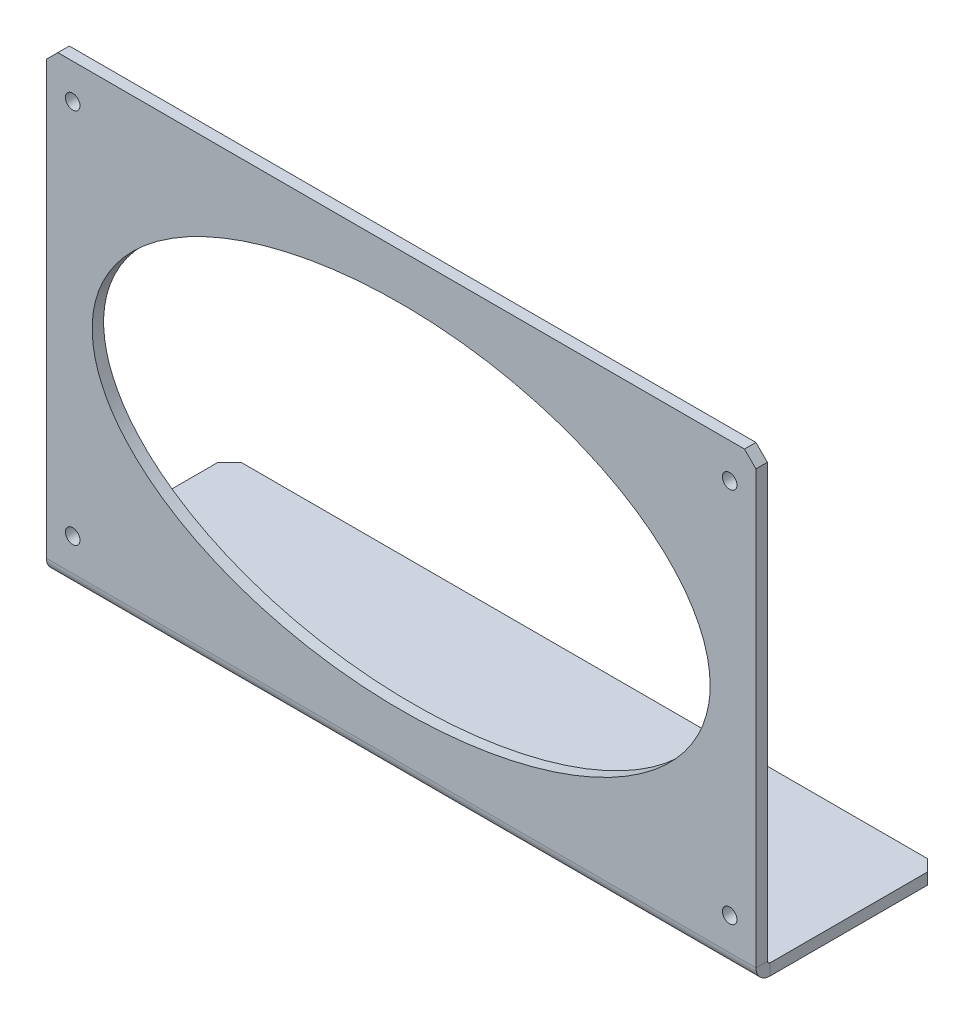
ISO-10303-21;
HEADER;
FILE_DESCRIPTION(('STEP AP214'),'2;1');
FILE_NAME('part.step','',(''),(''),'','','');
FILE_SCHEMA(('AUTOMOTIVE_DESIGN { 1 0 10303 214 1 1 1 1 }'));
ENDSEC;
DATA;
#1=APPLICATION_CONTEXT('core data for automotive mechanical design processes');
#2=APPLICATION_PROTOCOL_DEFINITION('international standard','automotive_design',2000,#1);
#3=PRODUCT_CONTEXT('',#1,'mechanical');
#4=PRODUCT('Part','Part','',(#3));
#5=PRODUCT_RELATED_PRODUCT_CATEGORY('part','',(#4));
#6=PRODUCT_DEFINITION_FORMATION('','',#4);
#7=PRODUCT_DEFINITION_CONTEXT('part definition',#1,'design');
#8=PRODUCT_DEFINITION('design','',#6,#7);
#9=PRODUCT_DEFINITION_SHAPE('','',#8);
#10=(LENGTH_UNIT() NAMED_UNIT(*) SI_UNIT(.MILLI.,.METRE.));
#11=(NAMED_UNIT(*) PLANE_ANGLE_UNIT() SI_UNIT($,.RADIAN.));
#12=(NAMED_UNIT(*) SI_UNIT($,.STERADIAN.) SOLID_ANGLE_UNIT());
#13=UNCERTAINTY_MEASURE_WITH_UNIT(LENGTH_MEASURE(1.E-05),#10,'distance_accuracy_value','');
#14=(GEOMETRIC_REPRESENTATION_CONTEXT(3) GLOBAL_UNCERTAINTY_ASSIGNED_CONTEXT((#13)) GLOBAL_UNIT_ASSIGNED_CONTEXT((#10,
#11,#12)) REPRESENTATION_CONTEXT('',''));
#15=CARTESIAN_POINT('',(0.,0.,0.));
#16=DIRECTION('',(0.,0.,1.));
#17=DIRECTION('',(1.,0.,0.));
#18=AXIS2_PLACEMENT_3D('',#15,#16,#17);
#19=CARTESIAN_POINT('',(98.425,3.9116,50.8));
#20=DIRECTION('',(1.,0.,0.));
#21=DIRECTION('',(0.,0.,-1.));
#22=AXIS2_PLACEMENT_3D('',#19,#20,#21);
#23=PLANE('',#22);
#24=DIRECTION('',(0.,0.,-1.));
#25=VECTOR('',#24,1.);
#26=CARTESIAN_POINT('',(98.425,3.9116,50.8));
#27=LINE('',#26,#25);
#28=CARTESIAN_POINT('',(98.425,3.9116,50.8));
#29=VERTEX_POINT('',#28);
#30=CARTESIAN_POINT('',(98.425,3.9116,47.625));
#31=VERTEX_POINT('',#30);
#32=EDGE_CURVE('E145',#29,#31,#27,.T.);
#33=ORIENTED_EDGE('',*,*,#32,.F.);
#34=CARTESIAN_POINT('',(98.425,3.9116,46.8884));
#35=DIRECTION('',(1.,0.,0.));
#36=DIRECTION('',(0.,0.,-1.));
#37=AXIS2_PLACEMENT_3D('',#34,#35,#36);
#38=CIRCLE('',#37,3.9116);
#39=CARTESIAN_POINT('',(98.425,0.,46.8884));
#40=VERTEX_POINT('',#39);
#41=EDGE_CURVE('E149',#40,#29,#38,.F.);
#42=ORIENTED_EDGE('',*,*,#41,.F.);
#43=DIRECTION('',(0.,-1.,0.));
#44=VECTOR('',#43,1.);
#45=CARTESIAN_POINT('',(98.425,3.175,46.8884));
#46=LINE('',#45,#44);
#47=CARTESIAN_POINT('',(98.425,3.175,46.8884));
#48=VERTEX_POINT('',#47);
#49=EDGE_CURVE('E157',#48,#40,#46,.T.);
#50=ORIENTED_EDGE('',*,*,#49,.F.);
#51=CARTESIAN_POINT('',(98.425,3.9116,46.8884));
#52=DIRECTION('',(1.,0.,0.));
#53=DIRECTION('',(0.,0.,-1.));
#54=AXIS2_PLACEMENT_3D('',#51,#52,#53);
#55=CIRCLE('',#54,0.7366);
#56=EDGE_CURVE('E151',#48,#31,#55,.F.);
#57=ORIENTED_EDGE('',*,*,#56,.T.);
#58=EDGE_LOOP('',(#33,#42,#50,#57));
#59=FACE_BOUND('',#58,.T.);
#60=ADVANCED_FACE('F57',(#59),#23,.T.);
#61=CARTESIAN_POINT('',(98.425,3.175,46.8884));
#62=DIRECTION('',(1.,0.,0.));
#63=DIRECTION('',(0.,0.,-1.));
#64=AXIS2_PLACEMENT_3D('',#61,#62,#63);
#65=PLANE('',#64);
#66=DIRECTION('',(0.,1.,0.));
#67=VECTOR('',#66,1.);
#68=CARTESIAN_POINT('',(98.425,0.,47.625));
#69=LINE('',#68,#67);
#70=CARTESIAN_POINT('',(98.425,123.825,47.625));
#71=VERTEX_POINT('',#70);
#72=EDGE_CURVE('E178',#31,#71,#69,.T.);
#73=ORIENTED_EDGE('',*,*,#72,.T.);
#74=DIRECTION('',(0.,0.,1.));
#75=VECTOR('',#74,1.);
#76=CARTESIAN_POINT('',(98.425,123.825,46.8884));
#77=LINE('',#76,#75);
#78=CARTESIAN_POINT('',(98.425,123.825,50.8));
#79=VERTEX_POINT('',#78);
#80=EDGE_CURVE('E177',#71,#79,#77,.T.);
#81=ORIENTED_EDGE('',*,*,#80,.T.);
#82=DIRECTION('',(0.,1.,0.));
#83=VECTOR('',#82,1.);
#84=CARTESIAN_POINT('',(98.425,0.,50.8));
#85=LINE('',#84,#83);
#86=EDGE_CURVE('E165',#29,#79,#85,.T.);
#87=ORIENTED_EDGE('',*,*,#86,.F.);
#88=ORIENTED_EDGE('',*,*,#32,.T.);
#89=EDGE_LOOP('',(#73,#81,#87,#88));
#90=FACE_BOUND('',#89,.T.);
#91=ADVANCED_FACE('F175',(#90),#65,.T.);
#92=CARTESIAN_POINT('',(-98.425,0.,46.8884));
#93=DIRECTION('',(-1.,0.,0.));
#94=DIRECTION('',(0.,0.,1.));
#95=AXIS2_PLACEMENT_3D('',#92,#93,#94);
#96=PLANE('',#95);
#97=DIRECTION('',(0.,1.,0.));
#98=VECTOR('',#97,1.);
#99=CARTESIAN_POINT('',(-98.425,0.,46.8884));
#100=LINE('',#99,#98);
#101=CARTESIAN_POINT('',(-98.425,0.,46.8884));
#102=VERTEX_POINT('',#101);
#103=CARTESIAN_POINT('',(-98.425,3.175,46.8884));
#104=VERTEX_POINT('',#103);
#105=EDGE_CURVE('E221',#102,#104,#100,.T.);
#106=ORIENTED_EDGE('',*,*,#105,.F.);
#107=CARTESIAN_POINT('',(-98.425,3.9116,46.8884));
#108=DIRECTION('',(1.,0.,0.));
#109=DIRECTION('',(0.,0.,-1.));
#110=AXIS2_PLACEMENT_3D('',#107,#108,#109);
#111=CIRCLE('',#110,3.9116);
#112=CARTESIAN_POINT('',(-98.425,3.9116,50.8));
#113=VERTEX_POINT('',#112);
#114=EDGE_CURVE('E197',#102,#113,#111,.F.);
#115=ORIENTED_EDGE('',*,*,#114,.T.);
#116=DIRECTION('',(0.,0.,1.));
#117=VECTOR('',#116,1.);
#118=CARTESIAN_POINT('',(-98.425,3.9116,47.625));
#119=LINE('',#118,#117);
#120=CARTESIAN_POINT('',(-98.425,3.9116,47.625));
#121=VERTEX_POINT('',#120);
#122=EDGE_CURVE('E219',#121,#113,#119,.T.);
#123=ORIENTED_EDGE('',*,*,#122,.F.);
#124=CARTESIAN_POINT('',(-98.425,3.9116,46.8884));
#125=DIRECTION('',(1.,0.,0.));
#126=DIRECTION('',(0.,0.,-1.));
#127=AXIS2_PLACEMENT_3D('',#124,#125,#126);
#128=CIRCLE('',#127,0.7366);
#129=EDGE_CURVE('E203',#104,#121,#128,.F.);
#130=ORIENTED_EDGE('',*,*,#129,.F.);
#131=EDGE_LOOP('',(#106,#115,#123,#130));
#132=FACE_BOUND('',#131,.T.);
#133=ADVANCED_FACE('F282',(#132),#96,.T.);
#134=CARTESIAN_POINT('',(-98.425,3.9116,47.625));
#135=DIRECTION('',(-1.,0.,0.));
#136=DIRECTION('',(0.,0.,1.));
#137=AXIS2_PLACEMENT_3D('',#134,#135,#136);
#138=PLANE('',#137);
#139=DIRECTION('',(0.,0.,-1.));
#140=VECTOR('',#139,1.);
#141=CARTESIAN_POINT('',(-98.425,3.175,0.));
#142=LINE('',#141,#140);
#143=CARTESIAN_POINT('',(-98.425,3.175,3.17500000000003));
#144=VERTEX_POINT('',#143);
#145=EDGE_CURVE('E201',#144,#104,#142,.F.);
#146=ORIENTED_EDGE('',*,*,#145,.F.);
#147=DIRECTION('',(0.,-1.,0.));
#148=VECTOR('',#147,1.);
#149=CARTESIAN_POINT('',(-98.425,3.9116,3.17500000000003));
#150=LINE('',#149,#148);
#151=CARTESIAN_POINT('',(-98.425,0.,3.17500000000003));
#152=VERTEX_POINT('',#151);
#153=EDGE_CURVE('E244',#144,#152,#150,.T.);
#154=ORIENTED_EDGE('',*,*,#153,.T.);
#155=DIRECTION('',(0.,0.,1.));
#156=VECTOR('',#155,1.);
#157=CARTESIAN_POINT('',(-98.425,0.,0.));
#158=LINE('',#157,#156);
#159=EDGE_CURVE('E199',#152,#102,#158,.T.);
#160=ORIENTED_EDGE('',*,*,#159,.T.);
#161=ORIENTED_EDGE('',*,*,#105,.T.);
#162=EDGE_LOOP('',(#146,#154,#160,#161));
#163=FACE_BOUND('',#162,.T.);
#164=ADVANCED_FACE('F276',(#163),#138,.T.);
#165=CARTESIAN_POINT('',(98.425,0.,47.625));
#166=DIRECTION('',(0.,0.,1.));
#167=DIRECTION('',(1.,0.,0.));
#168=AXIS2_PLACEMENT_3D('',#165,#166,#167);
#169=PLANE('',#168);
#170=CARTESIAN_POINT('',(0.,65.4558,47.625));
#171=DIRECTION('',(0.,0.,1.));
#172=DIRECTION('',(1.,0.,0.));
#173=AXIS2_PLACEMENT_3D('',#170,#171,#172);
#174=ELLIPSE('',#173,85.725,48.8442);
#175=CARTESIAN_POINT('',(85.725,65.4558,47.625));
#176=VERTEX_POINT('',#175);
#177=EDGE_CURVE('E316',#176,#176,#174,.T.);
#178=ORIENTED_EDGE('',*,*,#177,.T.);
#179=EDGE_LOOP('',(#178));
#180=FACE_BOUND('',#179,.T.);
#181=CARTESIAN_POINT('',(91.1352000000007,117.2845,47.625));
#182=DIRECTION('',(0.,0.,-1.));
#183=DIRECTION('',(-1.,0.,0.));
#184=AXIS2_PLACEMENT_3D('',#181,#182,#183);
#185=CIRCLE('',#184,2.01929999999999);
#186=CARTESIAN_POINT('',(89.1159000000007,117.2845,47.625));
#187=VERTEX_POINT('',#186);
#188=EDGE_CURVE('E313',#187,#187,#185,.T.);
#189=ORIENTED_EDGE('',*,*,#188,.F.);
#190=EDGE_LOOP('',(#189));
#191=FACE_BOUND('',#190,.T.);
#192=CARTESIAN_POINT('',(-91.1351999999994,117.2845,47.625));
#193=DIRECTION('',(0.,0.,-1.));
#194=DIRECTION('',(-1.,0.,0.));
#195=AXIS2_PLACEMENT_3D('',#192,#193,#194);
#196=CIRCLE('',#195,2.01929999999999);
#197=CARTESIAN_POINT('',(-93.1544999999994,117.2845,47.625));
#198=VERTEX_POINT('',#197);
#199=EDGE_CURVE('E307',#198,#198,#196,.T.);
#200=ORIENTED_EDGE('',*,*,#199,.F.);
#201=EDGE_LOOP('',(#200));
#202=FACE_BOUND('',#201,.T.);
#203=CARTESIAN_POINT('',(-91.1351999999994,12.8905,47.625));
#204=DIRECTION('',(0.,0.,-1.));
#205=DIRECTION('',(-1.,0.,0.));
#206=AXIS2_PLACEMENT_3D('',#203,#204,#205);
#207=CIRCLE('',#206,2.01929999999999);
#208=CARTESIAN_POINT('',(-93.1544999999994,12.8905,47.625));
#209=VERTEX_POINT('',#208);
#210=EDGE_CURVE('E301',#209,#209,#207,.T.);
#211=ORIENTED_EDGE('',*,*,#210,.F.);
#212=EDGE_LOOP('',(#211));
#213=FACE_BOUND('',#212,.T.);
#214=CARTESIAN_POINT('',(91.1352000000007,12.8905,47.625));
#215=DIRECTION('',(0.,0.,-1.));
#216=DIRECTION('',(-1.,0.,0.));
#217=AXIS2_PLACEMENT_3D('',#214,#215,#216);
#218=CIRCLE('',#217,2.01929999999999);
#219=CARTESIAN_POINT('',(89.1159000000007,12.8905,47.625));
#220=VERTEX_POINT('',#219);
#221=EDGE_CURVE('E295',#220,#220,#218,.T.);
#222=ORIENTED_EDGE('',*,*,#221,.F.);
#223=EDGE_LOOP('',(#222));
#224=FACE_BOUND('',#223,.T.);
#225=DIRECTION('',(-1.,0.,0.));
#226=VECTOR('',#225,1.);
#227=CARTESIAN_POINT('',(98.425,127.,47.625));
#228=LINE('',#227,#226);
#229=CARTESIAN_POINT('',(95.25,127.,47.625));
#230=VERTEX_POINT('',#229);
#231=CARTESIAN_POINT('',(-95.25,127.,47.625));
#232=VERTEX_POINT('',#231);
#233=EDGE_CURVE('E217',#230,#232,#228,.T.);
#234=ORIENTED_EDGE('',*,*,#233,.F.);
#235=DIRECTION('',(-0.707106781186548,0.707106781186548,0.));
#236=VECTOR('',#235,1.);
#237=CARTESIAN_POINT('',(95.25,127.,47.625));
#238=LINE('',#237,#236);
#239=EDGE_CURVE('E239',#230,#71,#238,.F.);
#240=ORIENTED_EDGE('',*,*,#239,.T.);
#241=ORIENTED_EDGE('',*,*,#72,.F.);
#242=DIRECTION('',(-1.,0.,0.));
#243=VECTOR('',#242,1.);
#244=CARTESIAN_POINT('',(98.425,3.9116,47.625));
#245=LINE('',#244,#243);
#246=EDGE_CURVE('E191',#31,#121,#245,.T.);
#247=ORIENTED_EDGE('',*,*,#246,.T.);
#248=DIRECTION('',(0.,1.,0.));
#249=VECTOR('',#248,1.);
#250=CARTESIAN_POINT('',(-98.425,0.,47.625));
#251=LINE('',#250,#249);
#252=CARTESIAN_POINT('',(-98.425,123.825,47.625));
#253=VERTEX_POINT('',#252);
#254=EDGE_CURVE('E192',#121,#253,#251,.T.);
#255=ORIENTED_EDGE('',*,*,#254,.T.);
#256=DIRECTION('',(0.707106781186546,0.707106781186549,0.));
#257=VECTOR('',#256,1.);
#258=CARTESIAN_POINT('',(-98.425,123.825,47.625));
#259=LINE('',#258,#257);
#260=EDGE_CURVE('E228',#253,#232,#259,.T.);
#261=ORIENTED_EDGE('',*,*,#260,.T.);
#262=EDGE_LOOP('',(#234,#240,#241,#247,#255,#261));
#263=FACE_BOUND('',#262,.T.);
#264=ADVANCED_FACE('F289',(#180,#191,#202,#213,#224,#263),#169,.F.);
#265=CARTESIAN_POINT('',(98.425,127.,50.8));
#266=DIRECTION('',(0.,1.,0.));
#267=DIRECTION('',(0.,0.,1.));
#268=AXIS2_PLACEMENT_3D('',#265,#266,#267);
#269=PLANE('',#268);
#270=DIRECTION('',(-1.,0.,0.));
#271=VECTOR('',#270,1.);
#272=CARTESIAN_POINT('',(98.425,127.,50.8));
#273=LINE('',#272,#271);
#274=CARTESIAN_POINT('',(95.25,127.,50.8));
#275=VERTEX_POINT('',#274);
#276=CARTESIAN_POINT('',(-95.25,127.,50.8));
#277=VERTEX_POINT('',#276);
#278=EDGE_CURVE('E172',#275,#277,#273,.T.);
#279=ORIENTED_EDGE('',*,*,#278,.F.);
#280=DIRECTION('',(0.,0.,-1.));
#281=VECTOR('',#280,1.);
#282=CARTESIAN_POINT('',(95.25,127.,50.8));
#283=LINE('',#282,#281);
#284=EDGE_CURVE('E236',#275,#230,#283,.T.);
#285=ORIENTED_EDGE('',*,*,#284,.T.);
#286=ORIENTED_EDGE('',*,*,#233,.T.);
#287=DIRECTION('',(0.,0.,1.));
#288=VECTOR('',#287,1.);
#289=CARTESIAN_POINT('',(-95.25,127.,50.8));
#290=LINE('',#289,#288);
#291=EDGE_CURVE('E231',#232,#277,#290,.T.);
#292=ORIENTED_EDGE('',*,*,#291,.T.);
#293=EDGE_LOOP('',(#279,#285,#286,#292));
#294=FACE_BOUND('',#293,.T.);
#295=ADVANCED_FACE('F362',(#294),#269,.T.);
#296=CARTESIAN_POINT('',(98.425,0.,50.8));
#297=DIRECTION('',(0.,0.,1.));
#298=DIRECTION('',(1.,0.,0.));
#299=AXIS2_PLACEMENT_3D('',#296,#297,#298);
#300=PLANE('',#299);
#301=CARTESIAN_POINT('',(0.,65.4558,50.8));
#302=DIRECTION('',(0.,0.,1.));
#303=DIRECTION('',(1.,0.,0.));
#304=AXIS2_PLACEMENT_3D('',#301,#302,#303);
#305=ELLIPSE('',#304,85.725,48.8442);
#306=CARTESIAN_POINT('',(85.725,65.4558,50.8));
#307=VERTEX_POINT('',#306);
#308=EDGE_CURVE('E319',#307,#307,#305,.T.);
#309=ORIENTED_EDGE('',*,*,#308,.F.);
#310=EDGE_LOOP('',(#309));
#311=FACE_BOUND('',#310,.T.);
#312=CARTESIAN_POINT('',(91.1352000000007,117.2845,50.8));
#313=DIRECTION('',(0.,0.,-1.));
#314=DIRECTION('',(-1.,0.,0.));
#315=AXIS2_PLACEMENT_3D('',#312,#313,#314);
#316=CIRCLE('',#315,2.01929999999999);
#317=CARTESIAN_POINT('',(89.1159000000007,117.2845,50.8));
#318=VERTEX_POINT('',#317);
#319=EDGE_CURVE('E310',#318,#318,#316,.T.);
#320=ORIENTED_EDGE('',*,*,#319,.T.);
#321=EDGE_LOOP('',(#320));
#322=FACE_BOUND('',#321,.T.);
#323=CARTESIAN_POINT('',(-91.1351999999994,117.2845,50.8));
#324=DIRECTION('',(0.,0.,-1.));
#325=DIRECTION('',(-1.,0.,0.));
#326=AXIS2_PLACEMENT_3D('',#323,#324,#325);
#327=CIRCLE('',#326,2.01929999999999);
#328=CARTESIAN_POINT('',(-93.1544999999994,117.2845,50.8));
#329=VERTEX_POINT('',#328);
#330=EDGE_CURVE('E304',#329,#329,#327,.T.);
#331=ORIENTED_EDGE('',*,*,#330,.T.);
#332=EDGE_LOOP('',(#331));
#333=FACE_BOUND('',#332,.T.);
#334=CARTESIAN_POINT('',(-91.1351999999994,12.8905,50.8));
#335=DIRECTION('',(0.,0.,-1.));
#336=DIRECTION('',(-1.,0.,0.));
#337=AXIS2_PLACEMENT_3D('',#334,#335,#336);
#338=CIRCLE('',#337,2.01929999999999);
#339=CARTESIAN_POINT('',(-93.1544999999994,12.8905,50.8));
#340=VERTEX_POINT('',#339);
#341=EDGE_CURVE('E298',#340,#340,#338,.T.);
#342=ORIENTED_EDGE('',*,*,#341,.T.);
#343=EDGE_LOOP('',(#342));
#344=FACE_BOUND('',#343,.T.);
#345=CARTESIAN_POINT('',(91.1352000000007,12.8905,50.8));
#346=DIRECTION('',(0.,0.,-1.));
#347=DIRECTION('',(-1.,0.,0.));
#348=AXIS2_PLACEMENT_3D('',#345,#346,#347);
#349=CIRCLE('',#348,2.01929999999999);
#350=CARTESIAN_POINT('',(89.1159000000007,12.8905,50.8));
#351=VERTEX_POINT('',#350);
#352=EDGE_CURVE('E195',#351,#351,#349,.T.);
#353=ORIENTED_EDGE('',*,*,#352,.T.);
#354=EDGE_LOOP('',(#353));
#355=FACE_BOUND('',#354,.T.);
#356=ORIENTED_EDGE('',*,*,#86,.T.);
#357=DIRECTION('',(0.707106781186548,-0.707106781186548,0.));
#358=VECTOR('',#357,1.);
#359=CARTESIAN_POINT('',(160.3375,61.9125,50.8));
#360=LINE('',#359,#358);
#361=EDGE_CURVE('E242',#79,#275,#360,.F.);
#362=ORIENTED_EDGE('',*,*,#361,.T.);
#363=ORIENTED_EDGE('',*,*,#278,.T.);
#364=DIRECTION('',(-0.707106781186546,-0.707106781186549,0.));
#365=VECTOR('',#364,1.);
#366=CARTESIAN_POINT('',(-61.9125000000005,160.3375,50.8));
#367=LINE('',#366,#365);
#368=CARTESIAN_POINT('',(-98.425,123.825,50.8));
#369=VERTEX_POINT('',#368);
#370=EDGE_CURVE('E234',#277,#369,#367,.T.);
#371=ORIENTED_EDGE('',*,*,#370,.T.);
#372=DIRECTION('',(0.,1.,0.));
#373=VECTOR('',#372,1.);
#374=CARTESIAN_POINT('',(-98.425,0.,50.8));
#375=LINE('',#374,#373);
#376=EDGE_CURVE('E168',#113,#369,#375,.T.);
#377=ORIENTED_EDGE('',*,*,#376,.F.);
#378=DIRECTION('',(-1.,0.,0.));
#379=VECTOR('',#378,1.);
#380=CARTESIAN_POINT('',(98.425,3.9116,50.8));
#381=LINE('',#380,#379);
#382=EDGE_CURVE('E163',#29,#113,#381,.T.);
#383=ORIENTED_EDGE('',*,*,#382,.F.);
#384=EDGE_LOOP('',(#356,#362,#363,#371,#377,#383));
#385=FACE_BOUND('',#384,.T.);
#386=ADVANCED_FACE('F164',(#311,#322,#333,#344,#355,#385),#300,.T.);
#387=CARTESIAN_POINT('',(98.425,3.9116,46.8884));
#388=DIRECTION('',(-1.,0.,0.));
#389=DIRECTION('',(0.,0.,1.));
#390=AXIS2_PLACEMENT_3D('',#387,#388,#389);
#391=CYLINDRICAL_SURFACE('',#390,3.9116);
#392=ORIENTED_EDGE('',*,*,#114,.F.);
#393=DIRECTION('',(-1.,0.,0.));
#394=VECTOR('',#393,1.);
#395=CARTESIAN_POINT('',(98.425,0.,46.8884));
#396=LINE('',#395,#394);
#397=EDGE_CURVE('E173',#40,#102,#396,.T.);
#398=ORIENTED_EDGE('',*,*,#397,.F.);
#399=ORIENTED_EDGE('',*,*,#41,.T.);
#400=ORIENTED_EDGE('',*,*,#382,.T.);
#401=EDGE_LOOP('',(#392,#398,#399,#400));
#402=FACE_BOUND('',#401,.T.);
#403=ADVANCED_FACE('F181',(#402),#391,.T.);
#404=CARTESIAN_POINT('',(98.425,0.,0.));
#405=DIRECTION('',(0.,-1.,0.));
#406=DIRECTION('',(0.,0.,-1.));
#407=AXIS2_PLACEMENT_3D('',#404,#405,#406);
#408=PLANE('',#407);
#409=DIRECTION('',(-1.,0.,0.));
#410=VECTOR('',#409,1.);
#411=CARTESIAN_POINT('',(98.425,0.,0.));
#412=LINE('',#411,#410);
#413=CARTESIAN_POINT('',(95.25,0.,0.));
#414=VERTEX_POINT('',#413);
#415=CARTESIAN_POINT('',(-95.25,0.,0.));
#416=VERTEX_POINT('',#415);
#417=EDGE_CURVE('E213',#414,#416,#412,.T.);
#418=ORIENTED_EDGE('',*,*,#417,.F.);
#419=DIRECTION('',(-0.707106781186548,0.,-0.707106781186548));
#420=VECTOR('',#419,1.);
#421=CARTESIAN_POINT('',(96.8375,0.,1.58750000000001));
#422=LINE('',#421,#420);
#423=CARTESIAN_POINT('',(98.425,0.,3.17500000000002));
#424=VERTEX_POINT('',#423);
#425=EDGE_CURVE('E80',#414,#424,#422,.F.);
#426=ORIENTED_EDGE('',*,*,#425,.T.);
#427=DIRECTION('',(0.,0.,1.));
#428=VECTOR('',#427,1.);
#429=CARTESIAN_POINT('',(98.425,0.,0.));
#430=LINE('',#429,#428);
#431=EDGE_CURVE('E183',#424,#40,#430,.T.);
#432=ORIENTED_EDGE('',*,*,#431,.T.);
#433=ORIENTED_EDGE('',*,*,#397,.T.);
#434=ORIENTED_EDGE('',*,*,#159,.F.);
#435=DIRECTION('',(-0.707106781186546,0.,0.707106781186549));
#436=VECTOR('',#435,1.);
#437=CARTESIAN_POINT('',(1.58749999999956,0.,-96.8375));
#438=LINE('',#437,#436);
#439=EDGE_CURVE('E247',#152,#416,#438,.F.);
#440=ORIENTED_EDGE('',*,*,#439,.T.);
#441=EDGE_LOOP('',(#418,#426,#432,#433,#434,#440));
#442=FACE_BOUND('',#441,.T.);
#443=ADVANCED_FACE('F264',(#442),#408,.T.);
#444=CARTESIAN_POINT('',(98.425,3.175,0.));
#445=DIRECTION('',(0.,0.,-1.));
#446=DIRECTION('',(-1.,0.,0.));
#447=AXIS2_PLACEMENT_3D('',#444,#445,#446);
#448=PLANE('',#447);
#449=DIRECTION('',(-1.,0.,0.));
#450=VECTOR('',#449,1.);
#451=CARTESIAN_POINT('',(98.425,3.175,0.));
#452=LINE('',#451,#450);
#453=CARTESIAN_POINT('',(95.25,3.175,0.));
#454=VERTEX_POINT('',#453);
#455=CARTESIAN_POINT('',(-95.25,3.175,0.));
#456=VERTEX_POINT('',#455);
#457=EDGE_CURVE('E211',#454,#456,#452,.T.);
#458=ORIENTED_EDGE('',*,*,#457,.F.);
#459=DIRECTION('',(0.,-1.,0.));
#460=VECTOR('',#459,1.);
#461=CARTESIAN_POINT('',(95.25,3.175,0.));
#462=LINE('',#461,#460);
#463=EDGE_CURVE('E255',#454,#414,#462,.T.);
#464=ORIENTED_EDGE('',*,*,#463,.T.);
#465=ORIENTED_EDGE('',*,*,#417,.T.);
#466=DIRECTION('',(0.,1.,0.));
#467=VECTOR('',#466,1.);
#468=CARTESIAN_POINT('',(-95.25,3.175,0.));
#469=LINE('',#468,#467);
#470=EDGE_CURVE('E250',#416,#456,#469,.T.);
#471=ORIENTED_EDGE('',*,*,#470,.T.);
#472=EDGE_LOOP('',(#458,#464,#465,#471));
#473=FACE_BOUND('',#472,.T.);
#474=ADVANCED_FACE('F261',(#473),#448,.T.);
#475=CARTESIAN_POINT('',(98.425,3.175,0.));
#476=DIRECTION('',(0.,-1.,0.));
#477=DIRECTION('',(0.,0.,-1.));
#478=AXIS2_PLACEMENT_3D('',#475,#476,#477);
#479=PLANE('',#478);
#480=DIRECTION('',(0.,0.,-1.));
#481=VECTOR('',#480,1.);
#482=CARTESIAN_POINT('',(98.425,3.175,0.));
#483=LINE('',#482,#481);
#484=CARTESIAN_POINT('',(98.425,3.175,3.17500000000002));
#485=VERTEX_POINT('',#484);
#486=EDGE_CURVE('E185',#485,#48,#483,.F.);
#487=ORIENTED_EDGE('',*,*,#486,.F.);
#488=DIRECTION('',(0.707106781186548,0.,0.707106781186548));
#489=VECTOR('',#488,1.);
#490=CARTESIAN_POINT('',(95.25,3.175,0.));
#491=LINE('',#490,#489);
#492=EDGE_CURVE('E11',#485,#454,#491,.F.);
#493=ORIENTED_EDGE('',*,*,#492,.T.);
#494=ORIENTED_EDGE('',*,*,#457,.T.);
#495=DIRECTION('',(0.707106781186546,0.,-0.707106781186549));
#496=VECTOR('',#495,1.);
#497=CARTESIAN_POINT('',(-98.425,3.175,3.17500000000003));
#498=LINE('',#497,#496);
#499=EDGE_CURVE('E253',#456,#144,#498,.F.);
#500=ORIENTED_EDGE('',*,*,#499,.T.);
#501=ORIENTED_EDGE('',*,*,#145,.T.);
#502=DIRECTION('',(-1.,0.,0.));
#503=VECTOR('',#502,1.);
#504=CARTESIAN_POINT('',(98.425,3.175,46.8884));
#505=LINE('',#504,#503);
#506=EDGE_CURVE('E208',#48,#104,#505,.T.);
#507=ORIENTED_EDGE('',*,*,#506,.F.);
#508=EDGE_LOOP('',(#487,#493,#494,#500,#501,#507));
#509=FACE_BOUND('',#508,.T.);
#510=ADVANCED_FACE('F273',(#509),#479,.F.);
#511=CARTESIAN_POINT('',(98.425,3.9116,46.8884));
#512=DIRECTION('',(-1.,0.,0.));
#513=DIRECTION('',(0.,0.,1.));
#514=AXIS2_PLACEMENT_3D('',#511,#512,#513);
#515=CYLINDRICAL_SURFACE('',#514,0.7366);
#516=ORIENTED_EDGE('',*,*,#129,.T.);
#517=ORIENTED_EDGE('',*,*,#246,.F.);
#518=ORIENTED_EDGE('',*,*,#56,.F.);
#519=ORIENTED_EDGE('',*,*,#506,.T.);
#520=EDGE_LOOP('',(#516,#517,#518,#519));
#521=FACE_BOUND('',#520,.T.);
#522=ADVANCED_FACE('F281',(#521),#515,.F.);
#523=CARTESIAN_POINT('',(98.425,3.9116,46.8884));
#524=DIRECTION('',(1.,0.,0.));
#525=DIRECTION('',(0.,0.,-1.));
#526=AXIS2_PLACEMENT_3D('',#523,#524,#525);
#527=PLANE('',#526);
#528=ORIENTED_EDGE('',*,*,#431,.F.);
#529=DIRECTION('',(0.,1.,0.));
#530=VECTOR('',#529,1.);
#531=CARTESIAN_POINT('',(98.425,3.9116,3.17500000000003));
#532=LINE('',#531,#530);
#533=EDGE_CURVE('E66',#424,#485,#532,.T.);
#534=ORIENTED_EDGE('',*,*,#533,.T.);
#535=ORIENTED_EDGE('',*,*,#486,.T.);
#536=ORIENTED_EDGE('',*,*,#49,.T.);
#537=EDGE_LOOP('',(#528,#534,#535,#536));
#538=FACE_BOUND('',#537,.T.);
#539=ADVANCED_FACE('F344',(#538),#527,.T.);
#540=CARTESIAN_POINT('',(-98.425,3.9116,46.8884));
#541=DIRECTION('',(1.,0.,0.));
#542=DIRECTION('',(0.,0.,-1.));
#543=AXIS2_PLACEMENT_3D('',#540,#541,#542);
#544=PLANE('',#543);
#545=ORIENTED_EDGE('',*,*,#376,.T.);
#546=DIRECTION('',(0.,0.,-1.));
#547=VECTOR('',#546,1.);
#548=CARTESIAN_POINT('',(-98.425,123.825,47.625));
#549=LINE('',#548,#547);
#550=EDGE_CURVE('E156',#369,#253,#549,.T.);
#551=ORIENTED_EDGE('',*,*,#550,.T.);
#552=ORIENTED_EDGE('',*,*,#254,.F.);
#553=ORIENTED_EDGE('',*,*,#122,.T.);
#554=EDGE_LOOP('',(#545,#551,#552,#553));
#555=FACE_BOUND('',#554,.T.);
#556=ADVANCED_FACE('F285',(#555),#544,.F.);
#557=CARTESIAN_POINT('',(-98.425,123.825,46.8884));
#558=DIRECTION('',(-0.707106781186549,0.707106781186546,0.));
#559=DIRECTION('',(0.,0.,1.));
#560=AXIS2_PLACEMENT_3D('',#557,#558,#559);
#561=PLANE('',#560);
#562=ORIENTED_EDGE('',*,*,#370,.F.);
#563=ORIENTED_EDGE('',*,*,#291,.F.);
#564=ORIENTED_EDGE('',*,*,#260,.F.);
#565=ORIENTED_EDGE('',*,*,#550,.F.);
#566=EDGE_LOOP('',(#562,#563,#564,#565));
#567=FACE_BOUND('',#566,.T.);
#568=ADVANCED_FACE('F349',(#567),#561,.T.);
#569=CARTESIAN_POINT('',(95.25,127.,50.8));
#570=DIRECTION('',(-0.707106781186547,-0.707106781186547,0.));
#571=DIRECTION('',(0.,0.,-1.));
#572=AXIS2_PLACEMENT_3D('',#569,#570,#571);
#573=PLANE('',#572);
#574=ORIENTED_EDGE('',*,*,#361,.F.);
#575=ORIENTED_EDGE('',*,*,#80,.F.);
#576=ORIENTED_EDGE('',*,*,#239,.F.);
#577=ORIENTED_EDGE('',*,*,#284,.F.);
#578=EDGE_LOOP('',(#574,#575,#576,#577));
#579=FACE_BOUND('',#578,.T.);
#580=ADVANCED_FACE('F384',(#579),#573,.F.);
#581=CARTESIAN_POINT('',(-98.425,3.9116,3.17500000000003));
#582=DIRECTION('',(0.707106781186549,0.,0.707106781186546));
#583=DIRECTION('',(0.,-1.,0.));
#584=AXIS2_PLACEMENT_3D('',#581,#582,#583);
#585=PLANE('',#584);
#586=ORIENTED_EDGE('',*,*,#499,.F.);
#587=ORIENTED_EDGE('',*,*,#470,.F.);
#588=ORIENTED_EDGE('',*,*,#439,.F.);
#589=ORIENTED_EDGE('',*,*,#153,.F.);
#590=EDGE_LOOP('',(#586,#587,#588,#589));
#591=FACE_BOUND('',#590,.T.);
#592=ADVANCED_FACE('F270',(#591),#585,.F.);
#593=CARTESIAN_POINT('',(95.25,3.175,0.));
#594=DIRECTION('',(-0.707106781186547,0.,0.707106781186547));
#595=DIRECTION('',(0.,-1.,0.));
#596=AXIS2_PLACEMENT_3D('',#593,#594,#595);
#597=PLANE('',#596);
#598=ORIENTED_EDGE('',*,*,#492,.F.);
#599=ORIENTED_EDGE('',*,*,#533,.F.);
#600=ORIENTED_EDGE('',*,*,#425,.F.);
#601=ORIENTED_EDGE('',*,*,#463,.F.);
#602=EDGE_LOOP('',(#598,#599,#600,#601));
#603=FACE_BOUND('',#602,.T.);
#604=ADVANCED_FACE('F60',(#603),#597,.F.);
#605=CARTESIAN_POINT('',(91.1352000000007,12.8905,47.625));
#606=DIRECTION('',(0.,0.,-1.));
#607=DIRECTION('',(-1.,0.,0.));
#608=AXIS2_PLACEMENT_3D('',#605,#606,#607);
#609=CYLINDRICAL_SURFACE('',#608,2.01929999999999);
#610=ORIENTED_EDGE('',*,*,#352,.F.);
#611=EDGE_LOOP('',(#610));
#612=FACE_BOUND('',#611,.T.);
#613=ORIENTED_EDGE('',*,*,#221,.T.);
#614=EDGE_LOOP('',(#613));
#615=FACE_BOUND('',#614,.T.);
#616=ADVANCED_FACE('F339',(#612,#615),#609,.F.);
#617=CARTESIAN_POINT('',(-91.1351999999994,12.8905,47.625));
#618=DIRECTION('',(0.,0.,-1.));
#619=DIRECTION('',(-1.,0.,0.));
#620=AXIS2_PLACEMENT_3D('',#617,#618,#619);
#621=CYLINDRICAL_SURFACE('',#620,2.01929999999999);
#622=ORIENTED_EDGE('',*,*,#341,.F.);
#623=EDGE_LOOP('',(#622));
#624=FACE_BOUND('',#623,.T.);
#625=ORIENTED_EDGE('',*,*,#210,.T.);
#626=EDGE_LOOP('',(#625));
#627=FACE_BOUND('',#626,.T.);
#628=ADVANCED_FACE('F335',(#624,#627),#621,.F.);
#629=CARTESIAN_POINT('',(-91.1351999999994,117.2845,47.625));
#630=DIRECTION('',(0.,0.,-1.));
#631=DIRECTION('',(-1.,0.,0.));
#632=AXIS2_PLACEMENT_3D('',#629,#630,#631);
#633=CYLINDRICAL_SURFACE('',#632,2.01929999999999);
#634=ORIENTED_EDGE('',*,*,#330,.F.);
#635=EDGE_LOOP('',(#634));
#636=FACE_BOUND('',#635,.T.);
#637=ORIENTED_EDGE('',*,*,#199,.T.);
#638=EDGE_LOOP('',(#637));
#639=FACE_BOUND('',#638,.T.);
#640=ADVANCED_FACE('F331',(#636,#639),#633,.F.);
#641=CARTESIAN_POINT('',(91.1352000000007,117.2845,47.625));
#642=DIRECTION('',(0.,0.,-1.));
#643=DIRECTION('',(-1.,0.,0.));
#644=AXIS2_PLACEMENT_3D('',#641,#642,#643);
#645=CYLINDRICAL_SURFACE('',#644,2.01929999999999);
#646=ORIENTED_EDGE('',*,*,#319,.F.);
#647=EDGE_LOOP('',(#646));
#648=FACE_BOUND('',#647,.T.);
#649=ORIENTED_EDGE('',*,*,#188,.T.);
#650=EDGE_LOOP('',(#649));
#651=FACE_BOUND('',#650,.T.);
#652=ADVANCED_FACE('F327',(#648,#651),#645,.F.);
#653=CARTESIAN_POINT('',(0.,65.4558,0.));
#654=DIRECTION('',(0.,0.,1.));
#655=DIRECTION('',(1.,0.,0.));
#656=AXIS2_PLACEMENT_3D('',#653,#654,#655);
#657=ELLIPSE('',#656,85.725,48.8442);
#658=DIRECTION('',(0.,0.,1.));
#659=VECTOR('',#658,1.);
#660=SURFACE_OF_LINEAR_EXTRUSION('',#657,#659);
#661=ORIENTED_EDGE('',*,*,#308,.T.);
#662=EDGE_LOOP('',(#661));
#663=FACE_BOUND('',#662,.T.);
#664=ORIENTED_EDGE('',*,*,#177,.F.);
#665=EDGE_LOOP('',(#664));
#666=FACE_BOUND('',#665,.T.);
#667=ADVANCED_FACE('F324',(#663,#666),#660,.F.);
#668=CLOSED_SHELL('',(#60,#91,#133,#164,#264,#295,#386,#403,#443,#474,#510,#522,#539,#556,#568,
#580,#592,#604,#616,#628,#640,#652,#667));
#669=MANIFOLD_SOLID_BREP('B2',#668);
#670=ADVANCED_BREP_SHAPE_REPRESENTATION('',(#18,#669),#14);
#671=SHAPE_DEFINITION_REPRESENTATION(#9,#670);
ENDSEC;
END-ISO-10303-21;
